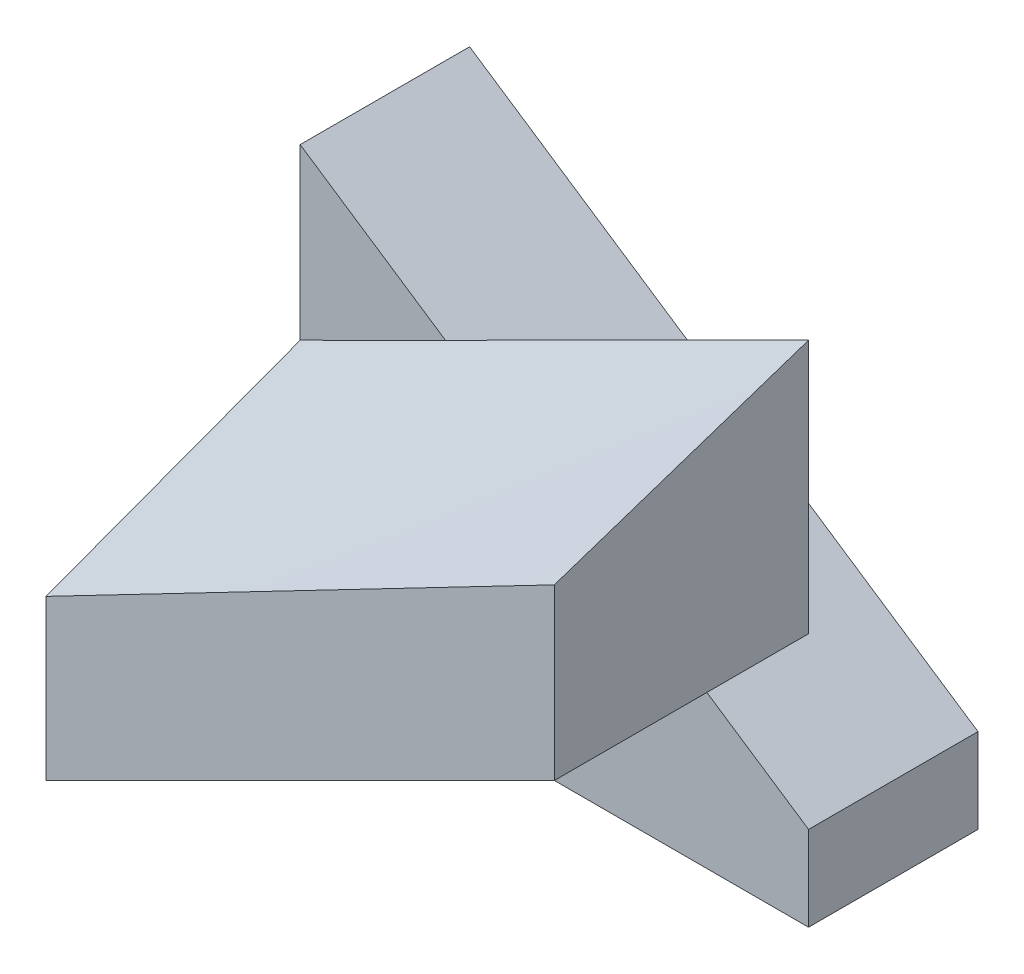
ISO-10303-21;
HEADER;
FILE_DESCRIPTION(('STEP AP214'),'2;1');
FILE_NAME('part.step','',(''),(''),'','','');
FILE_SCHEMA(('AUTOMOTIVE_DESIGN { 1 0 10303 214 1 1 1 1 }'));
ENDSEC;
DATA;
#1=APPLICATION_CONTEXT('core data for automotive mechanical design processes');
#2=APPLICATION_PROTOCOL_DEFINITION('international standard','automotive_design',2000,#1);
#3=PRODUCT_CONTEXT('',#1,'mechanical');
#4=PRODUCT('Part','Part','',(#3));
#5=PRODUCT_RELATED_PRODUCT_CATEGORY('part','',(#4));
#6=PRODUCT_DEFINITION_FORMATION('','',#4);
#7=PRODUCT_DEFINITION_CONTEXT('part definition',#1,'design');
#8=PRODUCT_DEFINITION('design','',#6,#7);
#9=PRODUCT_DEFINITION_SHAPE('','',#8);
#10=(LENGTH_UNIT() NAMED_UNIT(*) SI_UNIT(.MILLI.,.METRE.));
#11=(NAMED_UNIT(*) PLANE_ANGLE_UNIT() SI_UNIT($,.RADIAN.));
#12=(NAMED_UNIT(*) SI_UNIT($,.STERADIAN.) SOLID_ANGLE_UNIT());
#13=UNCERTAINTY_MEASURE_WITH_UNIT(LENGTH_MEASURE(1.E-05),#10,'distance_accuracy_value','');
#14=(GEOMETRIC_REPRESENTATION_CONTEXT(3) GLOBAL_UNCERTAINTY_ASSIGNED_CONTEXT((#13)) GLOBAL_UNIT_ASSIGNED_CONTEXT((#10,
#11,#12)) REPRESENTATION_CONTEXT('',''));
#15=CARTESIAN_POINT('',(0.,0.,0.));
#16=DIRECTION('',(0.,0.,1.));
#17=DIRECTION('',(1.,0.,0.));
#18=AXIS2_PLACEMENT_3D('',#15,#16,#17);
#19=CARTESIAN_POINT('',(0.,30.,25.));
#20=DIRECTION('',(-1.,0.,0.));
#21=DIRECTION('',(0.,-1.,0.));
#22=AXIS2_PLACEMENT_3D('',#19,#20,#21);
#23=PLANE('',#22);
#24=CARTESIAN_POINT('',(0.000158845899155132,24.9996884373651,24.999890016625));
#25=CARTESIAN_POINT('',(9.40900876160418E-05,25.2081489282927,24.3749344190889));
#26=CARTESIAN_POINT('',(4.30737554075727E-05,25.4165823132269,23.7499697800115));
#27=CARTESIAN_POINT('',(-3.8124387249438E-05,25.8334082179644,22.5000260762333));
#28=CARTESIAN_POINT('',(-6.83061738011946E-05,26.0418007377206,21.8750470115167));
#29=CARTESIAN_POINT('',(-0.000114479562406516,26.4585579471077,20.6250790488151));
#30=CARTESIAN_POINT('',(-0.000130471153136139,26.6669226367162,20.0000901508226));
#31=CARTESIAN_POINT('',(-0.000153416166124635,27.0836342911165,18.7501060885654));
#32=CARTESIAN_POINT('',(-0.000160369583734767,27.291981255899,18.1251109242978));
#33=CARTESIAN_POINT('',(-0.000168927685550457,27.7086646977155,16.8751168823485));
#34=CARTESIAN_POINT('',(-0.000170532368081898,27.917001174746,16.2501180046659));
#35=CARTESIAN_POINT('',(-0.000170340853141205,28.3336674614113,15.0001178851464));
#36=CARTESIAN_POINT('',(-0.000168544654975116,28.5419972710447,14.3751166433091));
#37=CARTESIAN_POINT('',(-0.000161869525905545,28.9586508478972,13.1251120128734));
#38=CARTESIAN_POINT('',(-0.000156990594413024,29.1669746151152,12.5001086242746));
#39=CARTESIAN_POINT('',(-0.000142346856214907,29.5836125663251,11.2500984641439));
#40=CARTESIAN_POINT('',(-0.000132582048180685,29.7919267503145,10.6250916926111));
#41=CARTESIAN_POINT('',(-0.000119472731499186,30.0002343355366,10.0000827217719));
#42=B_SPLINE_CURVE_WITH_KNOTS('',3,(#24,#25,#26,#27,#28,#29,#30,#31,#32,#33,#34,#35,#36,#37,#38,
#39,#40,#41),.UNSPECIFIED.,.F.,.F.,(4,2,2,2,2,2,2,2,4),(0.,1.97641784649956,3.95283795990498,
5.92925965051513,7.90568235768761,9.88210568346615,11.8585294125375,13.8349535192577,
15.8113781634311),.UNSPECIFIED.);
#43=CARTESIAN_POINT('',(0.,24.9997846091823,25.));
#44=VERTEX_POINT('',#43);
#45=CARTESIAN_POINT('',(-3.10665400835735E-05,30.0000609343592,10.000021510174));
#46=VERTEX_POINT('',#45);
#47=EDGE_CURVE('E94',#44,#46,#42,.T.);
#48=ORIENTED_EDGE('',*,*,#47,.F.);
#49=DIRECTION('',(0.,1.,0.));
#50=VECTOR('',#49,1.);
#51=CARTESIAN_POINT('',(0.,30.,25.));
#52=LINE('',#51,#50);
#53=CARTESIAN_POINT('',(0.,15.,25.));
#54=VERTEX_POINT('',#53);
#55=EDGE_CURVE('E213',#54,#44,#52,.T.);
#56=ORIENTED_EDGE('',*,*,#55,.F.);
#57=DIRECTION('',(0.,0.,-1.));
#58=VECTOR('',#57,1.);
#59=CARTESIAN_POINT('',(0.,15.,25.));
#60=LINE('',#59,#58);
#61=CARTESIAN_POINT('',(0.,15.,10.));
#62=VERTEX_POINT('',#61);
#63=EDGE_CURVE('E110',#54,#62,#60,.T.);
#64=ORIENTED_EDGE('',*,*,#63,.T.);
#65=DIRECTION('',(0.,1.,0.));
#66=VECTOR('',#65,1.);
#67=CARTESIAN_POINT('',(0.,30.,10.));
#68=LINE('',#67,#66);
#69=EDGE_CURVE('E108',#62,#46,#68,.T.);
#70=ORIENTED_EDGE('',*,*,#69,.T.);
#71=EDGE_LOOP('',(#48,#56,#64,#70));
#72=FACE_BOUND('',#71,.T.);
#73=ADVANCED_FACE('F33',(#72),#23,.F.);
#74=CARTESIAN_POINT('',(0.,0.,25.));
#75=DIRECTION('',(0.,0.,-1.));
#76=DIRECTION('',(-1.,0.,0.));
#77=AXIS2_PLACEMENT_3D('',#74,#75,#76);
#78=PLANE('',#77);
#79=CARTESIAN_POINT('',(-30.0001089678023,9.41004378726779,25.0000754482599));
#80=CARTESIAN_POINT('',(-28.7501437953252,10.0597020033733,25.000099420339));
#81=CARTESIAN_POINT('',(-27.50016501379,10.7093340358753,25.0001141117937));
#82=CARTESIAN_POINT('',(-25.0001804610467,12.0085451629464,25.000124807313));
#83=CARTESIAN_POINT('',(-23.7501746898476,12.6581242575328,25.0001208113836));
#84=CARTESIAN_POINT('',(-21.2501359245647,13.9572291780267,25.000094006013));
#85=CARTESIAN_POINT('',(-20.0001029304888,14.6067550039495,25.0000711965772));
#86=CARTESIAN_POINT('',(-17.5000299928659,15.9057930273842,25.0000207666232));
#87=CARTESIAN_POINT('',(-16.2499900493193,16.5553052248973,24.9999931461054));
#88=CARTESIAN_POINT('',(-13.749923975503,17.8543566548699,24.9999474528929));
#89=CARTESIAN_POINT('',(-12.4998978452353,18.5038958873336,24.9999293801996));
#90=CARTESIAN_POINT('',(-9.99987057808366,19.8030232646928,24.9999105093081));
#91=CARTESIAN_POINT('',(-8.74986944120654,20.4526114096015,24.9999097111146));
#92=CARTESIAN_POINT('',(-6.24988584079243,21.7518240562784,24.9999209688164));
#93=CARTESIAN_POINT('',(-4.99990337725805,22.4014485580517,24.9999330247136));
#94=CARTESIAN_POINT('',(-2.49990782993665,23.7006375025945,24.9999359353393));
#95=CARTESIAN_POINT('',(-1.24989474616118,24.3502019453862,24.9999267900756));
#96=CARTESIAN_POINT('',(0.000158845899155132,24.9996884373651,24.999890016625));
#97=B_SPLINE_CURVE_WITH_KNOTS('',3,(#79,#80,#81,#82,#83,#84,#85,#86,#87,#88,#89,#90,#91,#92,#93,
#94,#95,#96),.UNSPECIFIED.,.F.,.F.,(4,2,2,2,2,2,2,2,4),(0.,4.22613518198817,8.45226897549766,
12.6784015529602,16.9045337805403,21.1306666301373,25.356800607586,29.5829351725743,
33.809068167099),.UNSPECIFIED.);
#98=CARTESIAN_POINT('',(-30.,9.40997930085887,25.));
#99=VERTEX_POINT('',#98);
#100=EDGE_CURVE('E11',#99,#44,#97,.T.);
#101=ORIENTED_EDGE('',*,*,#100,.F.);
#102=DIRECTION('',(0.,-1.,0.));
#103=VECTOR('',#102,1.);
#104=CARTESIAN_POINT('',(-30.,0.,25.));
#105=LINE('',#104,#103);
#106=CARTESIAN_POINT('',(-30.,0.,25.));
#107=VERTEX_POINT('',#106);
#108=EDGE_CURVE('E113',#99,#107,#105,.T.);
#109=ORIENTED_EDGE('',*,*,#108,.T.);
#110=DIRECTION('',(0.894427190999916,0.447213595499958,0.));
#111=VECTOR('',#110,1.);
#112=CARTESIAN_POINT('',(0.,15.,25.));
#113=LINE('',#112,#111);
#114=EDGE_CURVE('E209',#107,#54,#113,.T.);
#115=ORIENTED_EDGE('',*,*,#114,.T.);
#116=ORIENTED_EDGE('',*,*,#55,.T.);
#117=EDGE_LOOP('',(#101,#109,#115,#116));
#118=FACE_BOUND('',#117,.T.);
#119=ADVANCED_FACE('F158',(#118),#78,.F.);
#120=CARTESIAN_POINT('',(0.,0.,10.));
#121=DIRECTION('',(0.,0.,-1.));
#122=DIRECTION('',(-1.,0.,0.));
#123=AXIS2_PLACEMENT_3D('',#120,#121,#122);
#124=PLANE('',#123);
#125=DIRECTION('',(0.894427190999916,0.447213595499958,0.));
#126=VECTOR('',#125,1.);
#127=CARTESIAN_POINT('',(0.,15.,10.));
#128=LINE('',#127,#126);
#129=CARTESIAN_POINT('',(-30.,0.,10.));
#130=VERTEX_POINT('',#129);
#131=CARTESIAN_POINT('',(-8.57142857142857,10.7142857142857,10.));
#132=VERTEX_POINT('',#131);
#133=EDGE_CURVE('E203',#130,#132,#128,.T.);
#134=ORIENTED_EDGE('',*,*,#133,.F.);
#135=DIRECTION('',(1.,0.,0.));
#136=VECTOR('',#135,1.);
#137=CARTESIAN_POINT('',(0.,0.,10.));
#138=LINE('',#137,#136);
#139=CARTESIAN_POINT('',(0.,0.,10.));
#140=VERTEX_POINT('',#139);
#141=EDGE_CURVE('E197',#130,#140,#138,.T.);
#142=ORIENTED_EDGE('',*,*,#141,.T.);
#143=DIRECTION('',(0.,1.,0.));
#144=VECTOR('',#143,1.);
#145=CARTESIAN_POINT('',(0.,5.,10.));
#146=LINE('',#145,#144);
#147=CARTESIAN_POINT('',(0.,5.,10.));
#148=VERTEX_POINT('',#147);
#149=EDGE_CURVE('E184',#140,#148,#146,.T.);
#150=ORIENTED_EDGE('',*,*,#149,.T.);
#151=DIRECTION('',(-0.832050294337844,0.554700196225229,0.));
#152=VECTOR('',#151,1.);
#153=CARTESIAN_POINT('',(-30.,25.,10.));
#154=LINE('',#153,#152);
#155=EDGE_CURVE('E180',#148,#132,#154,.T.);
#156=ORIENTED_EDGE('',*,*,#155,.T.);
#157=EDGE_LOOP('',(#134,#142,#150,#156));
#158=FACE_BOUND('',#157,.T.);
#159=ADVANCED_FACE('F153',(#158),#124,.F.);
#160=CARTESIAN_POINT('',(-21.4283882318403,19.2855248032532,9.9999209325888));
#161=CARTESIAN_POINT('',(-21.7855350347367,19.1069540098684,9.99992166623124));
#162=CARTESIAN_POINT('',(-22.142682652598,18.9283848464628,9.99992297300712));
#163=CARTESIAN_POINT('',(-22.8569788911004,18.5712484865187,9.99992628087402));
#164=CARTESIAN_POINT('',(-23.2141275117416,18.3926812899801,9.99992828196508));
#165=CARTESIAN_POINT('',(-23.9284251022901,18.0355475838597,9.99993252651048));
#166=CARTESIAN_POINT('',(-24.2855740721975,17.8569810742778,9.99993476996483));
#167=CARTESIAN_POINT('',(-24.9998714101063,17.4998468760715,9.99993884055407));
#168=CARTESIAN_POINT('',(-25.3570197781077,17.3212791874471,9.99994066768898));
#169=CARTESIAN_POINT('',(-26.0713147160349,16.9641402852597,9.99994307750407));
#170=CARTESIAN_POINT('',(-26.4284612859608,16.785569071697,9.99994366018435));
#171=CARTESIAN_POINT('',(-27.142751136286,16.4284201941613,9.99994254839057));
#172=CARTESIAN_POINT('',(-27.4998944166857,16.2498425301891,9.99994085391682));
#173=CARTESIAN_POINT('',(-28.2141759156548,15.8926772763573,9.99993396089843));
#174=CARTESIAN_POINT('',(-28.5713141342252,15.7140896864997,9.99992876235456));
#175=CARTESIAN_POINT('',(-29.285583314772,15.3569002735961,9.99991334087065));
#176=CARTESIAN_POINT('',(-29.6427142767505,15.1782984505545,9.99990311793217));
#177=CARTESIAN_POINT('',(-29.9998405846158,14.9996873214834,9.99988962263245));
#178=B_SPLINE_CURVE_WITH_KNOTS('',3,(#160,#161,#162,#163,#164,#165,#166,#167,#168,#169,#170,
#171,#172,#173,#174,#175,#176,#177),.UNSPECIFIED.,.F.,.F.,(4,2,2,2,2,2,2,2,4),(0.,
1.19790329475417,2.39580664151174,3.59371000384924,4.79161333287724,5.98951656619984,
7.18741962698956,8.38532242322399,9.58322484713928),.UNSPECIFIED.);
#179=CARTESIAN_POINT('',(-21.4284444472573,19.285637235958,9.99996046629439));
#180=VERTEX_POINT('',#179);
#181=CARTESIAN_POINT('',(-29.9999851616279,14.99990727827,9.99998972606822));
#182=VERTEX_POINT('',#181);
#183=EDGE_CURVE('E118',#180,#182,#178,.T.);
#184=ORIENTED_EDGE('',*,*,#183,.F.);
#185=CARTESIAN_POINT('',(-30.,25.,10.));
#186=VERTEX_POINT('',#185);
#187=EDGE_CURVE('E171',#180,#186,#154,.T.);
#188=ORIENTED_EDGE('',*,*,#187,.T.);
#189=DIRECTION('',(0.,-1.,0.));
#190=VECTOR('',#189,1.);
#191=CARTESIAN_POINT('',(-30.,0.,10.));
#192=LINE('',#191,#190);
#193=EDGE_CURVE('E174',#186,#182,#192,.T.);
#194=ORIENTED_EDGE('',*,*,#193,.T.);
#195=EDGE_LOOP('',(#184,#188,#194));
#196=FACE_BOUND('',#195,.T.);
#197=ADVANCED_FACE('F157',(#196),#124,.F.);
#198=CARTESIAN_POINT('',(0.,5.,10.));
#199=DIRECTION('',(-1.,0.,0.));
#200=DIRECTION('',(0.,0.,1.));
#201=AXIS2_PLACEMENT_3D('',#198,#199,#200);
#202=PLANE('',#201);
#203=DIRECTION('',(0.,1.,0.));
#204=VECTOR('',#203,1.);
#205=CARTESIAN_POINT('',(0.,5.,0.));
#206=LINE('',#205,#204);
#207=CARTESIAN_POINT('',(0.,0.,0.));
#208=VERTEX_POINT('',#207);
#209=CARTESIAN_POINT('',(0.,5.,0.));
#210=VERTEX_POINT('',#209);
#211=EDGE_CURVE('E182',#208,#210,#206,.T.);
#212=ORIENTED_EDGE('',*,*,#211,.T.);
#213=DIRECTION('',(0.,0.,-1.));
#214=VECTOR('',#213,1.);
#215=CARTESIAN_POINT('',(0.,5.,10.));
#216=LINE('',#215,#214);
#217=EDGE_CURVE('E240',#148,#210,#216,.T.);
#218=ORIENTED_EDGE('',*,*,#217,.F.);
#219=ORIENTED_EDGE('',*,*,#149,.F.);
#220=DIRECTION('',(0.,0.,-1.));
#221=VECTOR('',#220,1.);
#222=CARTESIAN_POINT('',(0.,0.,10.));
#223=LINE('',#222,#221);
#224=EDGE_CURVE('E230',#140,#208,#223,.T.);
#225=ORIENTED_EDGE('',*,*,#224,.T.);
#226=EDGE_LOOP('',(#212,#218,#219,#225));
#227=FACE_BOUND('',#226,.T.);
#228=ADVANCED_FACE('F238',(#227),#202,.F.);
#229=CARTESIAN_POINT('',(-30.,25.,10.));
#230=DIRECTION('',(-0.554700196225229,-0.832050294337844,0.));
#231=DIRECTION('',(0.832050294337844,-0.554700196225229,0.));
#232=AXIS2_PLACEMENT_3D('',#229,#230,#231);
#233=PLANE('',#232);
#234=DIRECTION('',(-0.832050294337844,0.554700196225229,0.));
#235=VECTOR('',#234,1.);
#236=CARTESIAN_POINT('',(-30.,25.,0.));
#237=LINE('',#236,#235);
#238=CARTESIAN_POINT('',(-30.,25.,0.));
#239=VERTEX_POINT('',#238);
#240=EDGE_CURVE('E235',#210,#239,#237,.T.);
#241=ORIENTED_EDGE('',*,*,#240,.T.);
#242=DIRECTION('',(0.,0.,-1.));
#243=VECTOR('',#242,1.);
#244=CARTESIAN_POINT('',(-30.,25.,10.));
#245=LINE('',#244,#243);
#246=EDGE_CURVE('E179',#186,#239,#245,.T.);
#247=ORIENTED_EDGE('',*,*,#246,.F.);
#248=ORIENTED_EDGE('',*,*,#187,.F.);
#249=EDGE_CURVE('E104',#132,#180,#154,.T.);
#250=ORIENTED_EDGE('',*,*,#249,.F.);
#251=ORIENTED_EDGE('',*,*,#155,.F.);
#252=ORIENTED_EDGE('',*,*,#217,.T.);
#253=EDGE_LOOP('',(#241,#247,#248,#250,#251,#252));
#254=FACE_BOUND('',#253,.T.);
#255=ADVANCED_FACE('F142',(#254),#233,.F.);
#256=CARTESIAN_POINT('',(-30.,0.,10.));
#257=DIRECTION('',(1.,0.,0.));
#258=DIRECTION('',(0.,0.,-1.));
#259=AXIS2_PLACEMENT_3D('',#256,#257,#258);
#260=PLANE('',#259);
#261=ORIENTED_EDGE('',*,*,#108,.F.);
#262=CARTESIAN_POINT('',(-29.9998405850685,14.9996873212569,9.99988962263243));
#263=CARTESIAN_POINT('',(-29.9999071454995,14.7668939598099,10.6249361548767));
#264=CARTESIAN_POINT('',(-29.9999591574701,14.5340722443163,11.2499721268567));
#265=CARTESIAN_POINT('',(-30.0000414181315,14.068386126518,12.5000290021315));
#266=CARTESIAN_POINT('',(-30.0000716667968,13.8355217241638,13.1250499054077));
#267=CARTESIAN_POINT('',(-30.0001177343851,13.369764612934,14.3750817311871));
#268=CARTESIAN_POINT('',(-30.0001335532966,13.136871904036,15.000092653682));
#269=CARTESIAN_POINT('',(-30.000156180004,12.6710688081147,16.2501082691036));
#270=CARTESIAN_POINT('',(-30.0001629877954,12.4381584210826,16.8751129620271));
#271=CARTESIAN_POINT('',(-30.0001712800931,11.972327201661,18.1251186733242));
#272=CARTESIAN_POINT('',(-30.0001727645978,11.7394063692683,18.7501196916966));
#273=CARTESIAN_POINT('',(-30.0001720940034,11.2735575618736,20.0001192187131));
#274=CARTESIAN_POINT('',(-30.0001699389035,11.04062958687,20.6251177273567));
#275=CARTESIAN_POINT('',(-30.000161846892,10.5747662142049,21.8751121394575));
#276=CARTESIAN_POINT('',(-30.0001559099796,10.3418308165417,22.5001080429142));
#277=CARTESIAN_POINT('',(-30.0001377647974,9.8759477204848,23.7500955076));
#278=CARTESIAN_POINT('',(-30.0001255565256,9.64300002208688,24.3750870688277));
#279=CARTESIAN_POINT('',(-30.0001089678023,9.4100437872678,25.0000754482599));
#280=B_SPLINE_CURVE_WITH_KNOTS('',3,(#262,#263,#264,#265,#266,#267,#268,#269,#270,#271,#272,
#273,#274,#275,#276,#277,#278,#279),.UNSPECIFIED.,.F.,.F.,(4,2,2,2,2,2,2,2,4),(0.,
2.00097058387019,4.00194350630729,6.0029180200323,8.00389353978583,10.0048696725602,
12.0058462331472,14.0068232468057,16.0078009421376),.UNSPECIFIED.);
#281=EDGE_CURVE('E43',#182,#99,#280,.T.);
#282=ORIENTED_EDGE('',*,*,#281,.F.);
#283=ORIENTED_EDGE('',*,*,#193,.F.);
#284=ORIENTED_EDGE('',*,*,#246,.T.);
#285=DIRECTION('',(0.,-1.,0.));
#286=VECTOR('',#285,1.);
#287=CARTESIAN_POINT('',(-30.,0.,0.));
#288=LINE('',#287,#286);
#289=CARTESIAN_POINT('',(-30.,0.,0.));
#290=VERTEX_POINT('',#289);
#291=EDGE_CURVE('E225',#239,#290,#288,.T.);
#292=ORIENTED_EDGE('',*,*,#291,.T.);
#293=DIRECTION('',(0.,0.,-1.));
#294=VECTOR('',#293,1.);
#295=CARTESIAN_POINT('',(-30.,0.,10.));
#296=LINE('',#295,#294);
#297=EDGE_CURVE('E206',#130,#290,#296,.T.);
#298=ORIENTED_EDGE('',*,*,#297,.F.);
#299=DIRECTION('',(0.,0.,-1.));
#300=VECTOR('',#299,1.);
#301=CARTESIAN_POINT('',(-30.,0.,25.));
#302=LINE('',#301,#300);
#303=EDGE_CURVE('E199',#107,#130,#302,.T.);
#304=ORIENTED_EDGE('',*,*,#303,.F.);
#305=EDGE_LOOP('',(#261,#282,#283,#284,#292,#298,#304));
#306=FACE_BOUND('',#305,.T.);
#307=ADVANCED_FACE('F131',(#306),#260,.F.);
#308=CARTESIAN_POINT('',(0.,0.,10.));
#309=DIRECTION('',(0.,1.,0.));
#310=DIRECTION('',(-1.,0.,0.));
#311=AXIS2_PLACEMENT_3D('',#308,#309,#310);
#312=PLANE('',#311);
#313=DIRECTION('',(1.,0.,0.));
#314=VECTOR('',#313,1.);
#315=CARTESIAN_POINT('',(0.,0.,0.));
#316=LINE('',#315,#314);
#317=EDGE_CURVE('E227',#290,#208,#316,.T.);
#318=ORIENTED_EDGE('',*,*,#317,.T.);
#319=ORIENTED_EDGE('',*,*,#224,.F.);
#320=ORIENTED_EDGE('',*,*,#141,.F.);
#321=ORIENTED_EDGE('',*,*,#297,.T.);
#322=EDGE_LOOP('',(#318,#319,#320,#321));
#323=FACE_BOUND('',#322,.T.);
#324=ADVANCED_FACE('F141',(#323),#312,.F.);
#325=CARTESIAN_POINT('',(0.,0.,0.));
#326=DIRECTION('',(0.,0.,-1.));
#327=DIRECTION('',(-1.,0.,0.));
#328=AXIS2_PLACEMENT_3D('',#325,#326,#327);
#329=PLANE('',#328);
#330=ORIENTED_EDGE('',*,*,#211,.F.);
#331=ORIENTED_EDGE('',*,*,#317,.F.);
#332=ORIENTED_EDGE('',*,*,#291,.F.);
#333=ORIENTED_EDGE('',*,*,#240,.F.);
#334=EDGE_LOOP('',(#330,#331,#332,#333));
#335=FACE_BOUND('',#334,.T.);
#336=ADVANCED_FACE('F147',(#335),#329,.T.);
#337=CARTESIAN_POINT('',(0.,15.,25.));
#338=DIRECTION('',(-0.447213595499958,0.894427190999916,0.));
#339=DIRECTION('',(-0.894427190999916,-0.447213595499958,0.));
#340=AXIS2_PLACEMENT_3D('',#337,#338,#339);
#341=PLANE('',#340);
#342=ORIENTED_EDGE('',*,*,#133,.T.);
#343=EDGE_CURVE('E202',#132,#62,#128,.T.);
#344=ORIENTED_EDGE('',*,*,#343,.T.);
#345=ORIENTED_EDGE('',*,*,#63,.F.);
#346=ORIENTED_EDGE('',*,*,#114,.F.);
#347=ORIENTED_EDGE('',*,*,#303,.T.);
#348=EDGE_LOOP('',(#342,#344,#345,#346,#347));
#349=FACE_BOUND('',#348,.T.);
#350=ADVANCED_FACE('F151',(#349),#341,.F.);
#351=CARTESIAN_POINT('',(0.,0.,10.));
#352=DIRECTION('',(0.,0.,-1.));
#353=DIRECTION('',(-1.,0.,0.));
#354=AXIS2_PLACEMENT_3D('',#351,#352,#353);
#355=PLANE('',#354);
#356=ORIENTED_EDGE('',*,*,#343,.F.);
#357=ORIENTED_EDGE('',*,*,#249,.T.);
#358=CARTESIAN_POINT('',(-0.000119472731508957,30.0002343355366,10.0000827217719));
#359=CARTESIAN_POINT('',(-0.892992942687939,29.5538450364969,10.0000960653958));
#360=CARTESIAN_POINT('',(-1.78586258515368,29.1074480809835,10.0001067169385));
#361=CARTESIAN_POINT('',(-3.57159053561106,28.214631938356,10.0001201721428));
#362=CARTESIAN_POINT('',(-4.46444884360488,27.7682127512461,10.0001229758059));
#363=CARTESIAN_POINT('',(-6.25015058567539,26.8753451567743,10.0001182715405));
#364=CARTESIAN_POINT('',(-7.14299401975554,26.4288967494193,10.0001107636143));
#365=CARTESIAN_POINT('',(-8.92866975640431,25.5359780847861,10.0000880357923));
#366=CARTESIAN_POINT('',(-9.82150205897493,25.0895078275119,10.000072815898));
#367=CARTESIAN_POINT('',(-11.6071619519961,24.1965580640358,10.0000391116522));
#368=CARTESIAN_POINT('',(-12.4999895424471,23.7500785578346,10.0000206273009));
#369=CARTESIAN_POINT('',(-14.2856474952131,22.857124986952,9.99998557914537));
#370=CARTESIAN_POINT('',(-15.1784778575283,22.4106509222707,9.99996901534116));
#371=CARTESIAN_POINT('',(-16.9641480572126,21.5177214070053,9.99994245649266));
#372=CARTESIAN_POINT('',(-17.8569878945831,21.071265956424,9.99993246144934));
#373=CARTESIAN_POINT('',(-19.642679028065,20.1783775306005,9.9999204052848));
#374=CARTESIAN_POINT('',(-20.5355303241786,19.7319445553629,9.99991834416514));
#375=CARTESIAN_POINT('',(-21.4283882318403,19.2855248032532,9.9999209325888));
#376=B_SPLINE_CURVE_WITH_KNOTS('',3,(#358,#359,#360,#361,#362,#363,#364,#365,#366,#367,#368,
#369,#370,#371,#372,#373,#374,#375),.UNSPECIFIED.,.F.,.F.,(4,2,2,2,2,2,2,2,4),(0.,
2.99472502256467,5.98944945671108,8.98417318372513,11.9788963598289,14.9736193027324,
17.9683423815191,20.9630659079531,23.9577900260467),.UNSPECIFIED.);
#377=EDGE_CURVE('E98',#46,#180,#376,.T.);
#378=ORIENTED_EDGE('',*,*,#377,.F.);
#379=ORIENTED_EDGE('',*,*,#69,.F.);
#380=EDGE_LOOP('',(#356,#357,#378,#379));
#381=FACE_BOUND('',#380,.T.);
#382=ADVANCED_FACE('F117',(#381),#355,.T.);
#383=CARTESIAN_POINT('',(-30.2978819486134,9.1997730321967,25.148836320677));
#384=CARTESIAN_POINT('',(-30.7539962939048,10.1049759373993,22.0872931405517));
#385=CARTESIAN_POINT('',(-31.2116008894709,11.013101840959,19.0267817954046));
#386=CARTESIAN_POINT('',(-31.6708478723645,11.9244491466823,15.9674076234699));
#387=CARTESIAN_POINT('',(-32.1319128732614,12.8393623391072,12.9092922297408));
#388=CARTESIAN_POINT('',(-32.5944743973854,13.7572108337479,9.85221301432177));
#389=CARTESIAN_POINT('',(-23.7676145354027,12.5849089700967,25.175945558309));
#390=CARTESIAN_POINT('',(-24.2145974953847,13.4722014446097,22.1080798946914));
#391=CARTESIAN_POINT('',(-24.6630668865381,14.3624094266351,19.0412434217414));
#392=CARTESIAN_POINT('',(-25.1129100560451,15.2553119573137,15.9753581397301));
#393=CARTESIAN_POINT('',(-25.5641479184293,16.1509500586931,12.9104385296726));
#394=CARTESIAN_POINT('',(-26.0168424471889,17.0494452864855,9.84652750142389));
#395=CARTESIAN_POINT('',(-17.2375033870749,15.970351408189,25.2031629922451));
#396=CARTESIAN_POINT('',(-17.6751763174196,16.8393830564541,22.1288511535182));
#397=CARTESIAN_POINT('',(-18.1139884797094,17.7106492106676,19.0553281080491));
#398=CARTESIAN_POINT('',(-18.5540392171212,18.5843447239679,15.9826626400995));
#399=CARTESIAN_POINT('',(-18.9948489776204,19.459528996086,12.9105227124461));
#400=CARTESIAN_POINT('',(-19.4366802753367,20.3367169260179,9.83909008735121));
#401=CARTESIAN_POINT('',(-10.706179052263,19.3534142848347,25.2295404275109));
#402=CARTESIAN_POINT('',(-11.1348648275716,20.2048183977459,22.1490059689477));
#403=CARTESIAN_POINT('',(-11.5645644458924,21.058211076946,19.0691734855494));
#404=CARTESIAN_POINT('',(-11.9949798907181,21.9130077885651,15.9898366335486));
#405=CARTESIAN_POINT('',(-12.4265950151634,22.7701575690721,12.9113304281948));
#406=CARTESIAN_POINT('',(-12.8593515066038,23.6295460432456,9.83361449438696));
#407=CARTESIAN_POINT('',(-4.1778416443266,22.7423357628828,25.2579859822594));
#408=CARTESIAN_POINT('',(-4.59577776914626,23.5726553564687,22.1700085689351));
#409=CARTESIAN_POINT('',(-5.01501488312718,24.4055267289373,19.0829319480116));
#410=CARTESIAN_POINT('',(-5.43550836120126,25.2408623520369,15.9967252215203));
#411=CARTESIAN_POINT('',(-5.8573191228686,26.0787817141527,12.9114305695381));
#412=CARTESIAN_POINT('',(-6.28052349404542,26.9194345220363,9.82710083939636));
#413=CARTESIAN_POINT('',(2.3524751773675,26.1273747902716,25.285061009932));
#414=CARTESIAN_POINT('',(1.94458694383086,26.9379863051484,22.1901265331811));
#415=CARTESIAN_POINT('',(1.53536726185792,27.7512093421684,19.0961139385406));
#416=CARTESIAN_POINT('',(1.12451594904871,28.5676326834156,16.0032310694213));
#417=CARTESIAN_POINT('',(0.712137030072502,29.3870522934048,12.9114059001412));
#418=CARTESIAN_POINT('',(0.298355991246337,30.2092220414663,9.82055154517951));
#419=B_SPLINE_SURFACE_WITH_KNOTS('',5,5,((#383,#384,#385,#386,#387,#388),(#389,#390,#391,#392,
#393,#394),(#395,#396,#397,#398,#399,#400),(#401,#402,#403,#404,#405,#406),(#407,#408,#409,#410,
#411,#412),(#413,#414,#415,#416,#417,#418)),.UNSPECIFIED.,.F.,.F.,.F.,(6,6),(6,6),
(-18.455334157974,18.3214211527799),(-8.08661041087761,8.036457115652),.UNSPECIFIED.);
#420=ORIENTED_EDGE('',*,*,#47,.T.);
#421=ORIENTED_EDGE('',*,*,#377,.T.);
#422=ORIENTED_EDGE('',*,*,#183,.T.);
#423=ORIENTED_EDGE('',*,*,#281,.T.);
#424=ORIENTED_EDGE('',*,*,#100,.T.);
#425=EDGE_LOOP('',(#420,#421,#422,#423,#424));
#426=FACE_BOUND('',#425,.T.);
#427=ADVANCED_FACE('F96',(#426),#419,.T.);
#428=CLOSED_SHELL('',(#73,#119,#159,#197,#228,#255,#307,#324,#336,#350,#382,#427));
#429=MANIFOLD_SOLID_BREP('B2',#428);
#430=ADVANCED_BREP_SHAPE_REPRESENTATION('',(#18,#429),#14);
#431=SHAPE_DEFINITION_REPRESENTATION(#9,#430);
ENDSEC;
END-ISO-10303-21;
